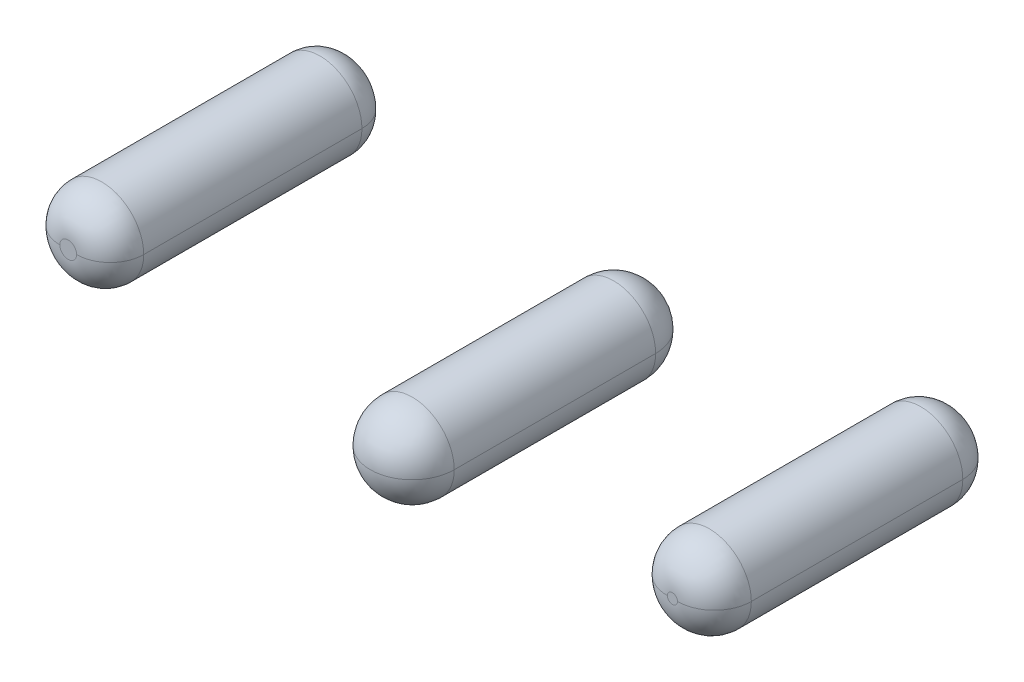
ISO-10303-21;
HEADER;
FILE_DESCRIPTION(('STEP AP214'),'2;1');
FILE_NAME('part.step','',(''),(''),'','','');
FILE_SCHEMA(('AUTOMOTIVE_DESIGN { 1 0 10303 214 1 1 1 1 }'));
ENDSEC;
DATA;
#1=APPLICATION_CONTEXT('core data for automotive mechanical design processes');
#2=APPLICATION_PROTOCOL_DEFINITION('international standard','automotive_design',2000,#1);
#3=PRODUCT_CONTEXT('',#1,'mechanical');
#4=PRODUCT('Part','Part','',(#3));
#5=PRODUCT_RELATED_PRODUCT_CATEGORY('part','',(#4));
#6=PRODUCT_DEFINITION_FORMATION('','',#4);
#7=PRODUCT_DEFINITION_CONTEXT('part definition',#1,'design');
#8=PRODUCT_DEFINITION('design','',#6,#7);
#9=PRODUCT_DEFINITION_SHAPE('','',#8);
#10=(LENGTH_UNIT() NAMED_UNIT(*) SI_UNIT(.MILLI.,.METRE.));
#11=(NAMED_UNIT(*) PLANE_ANGLE_UNIT() SI_UNIT($,.RADIAN.));
#12=(NAMED_UNIT(*) SI_UNIT($,.STERADIAN.) SOLID_ANGLE_UNIT());
#13=UNCERTAINTY_MEASURE_WITH_UNIT(LENGTH_MEASURE(1.E-05),#10,'distance_accuracy_value','');
#14=(GEOMETRIC_REPRESENTATION_CONTEXT(3) GLOBAL_UNCERTAINTY_ASSIGNED_CONTEXT((#13)) GLOBAL_UNIT_ASSIGNED_CONTEXT((#10,
#11,#12)) REPRESENTATION_CONTEXT('',''));
#15=CARTESIAN_POINT('',(0.,0.,0.));
#16=DIRECTION('',(0.,0.,1.));
#17=DIRECTION('',(1.,0.,0.));
#18=AXIS2_PLACEMENT_3D('',#15,#16,#17);
#19=CARTESIAN_POINT('',(1.8,-6.76461381012,0.7));
#20=DIRECTION('',(0.,0.,1.));
#21=DIRECTION('',(1.,0.,0.));
#22=AXIS2_PLACEMENT_3D('',#19,#20,#21);
#23=PLANE('',#22);
#24=CARTESIAN_POINT('',(1.8,-6.76461381012,0.7));
#25=DIRECTION('',(0.,0.,1.));
#26=DIRECTION('',(1.,0.,0.));
#27=AXIS2_PLACEMENT_3D('',#24,#25,#26);
#28=CIRCLE('',#27,0.03);
#29=CARTESIAN_POINT('',(1.83,-6.76461381012,0.7));
#30=VERTEX_POINT('',#29);
#31=CARTESIAN_POINT('',(1.77,-6.76461381012,0.7));
#32=VERTEX_POINT('',#31);
#33=EDGE_CURVE('P0_E92',#30,#32,#28,.T.);
#34=ORIENTED_EDGE('',*,*,#33,.T.);
#35=CARTESIAN_POINT('',(1.8,-6.76461381012,0.7));
#36=DIRECTION('',(0.,0.,1.));
#37=DIRECTION('',(1.,0.,0.));
#38=AXIS2_PLACEMENT_3D('',#35,#36,#37);
#39=CIRCLE('',#38,0.03);
#40=EDGE_CURVE('P0_E11',#32,#30,#39,.T.);
#41=ORIENTED_EDGE('',*,*,#40,.T.);
#42=EDGE_LOOP('',(#34,#41));
#43=FACE_BOUND('',#42,.T.);
#44=ADVANCED_FACE('P0_F17',(#43),#23,.T.);
#45=CARTESIAN_POINT('',(1.8,-6.76461381012,0.48));
#46=DIRECTION('',(0.,0.,1.));
#47=DIRECTION('',(-1.,0.,0.));
#48=AXIS2_PLACEMENT_3D('',#45,#46,#47);
#49=DEGENERATE_TOROIDAL_SURFACE('',#48,0.03,0.22,.T.);
#50=CARTESIAN_POINT('',(1.77,-6.76461381012,0.48));
#51=DIRECTION('',(0.,1.,0.));
#52=DIRECTION('',(1.,0.,0.));
#53=AXIS2_PLACEMENT_3D('',#50,#51,#52);
#54=CIRCLE('',#53,0.22);
#55=CARTESIAN_POINT('',(1.55,-6.76461381012,0.48));
#56=VERTEX_POINT('',#55);
#57=EDGE_CURVE('P0_E85',#56,#32,#54,.T.);
#58=ORIENTED_EDGE('',*,*,#57,.F.);
#59=CARTESIAN_POINT('',(1.8,-6.76461381012,0.480000000447));
#60=DIRECTION('',(0.,0.,-1.));
#61=DIRECTION('',(1.,0.,0.));
#62=AXIS2_PLACEMENT_3D('',#59,#60,#61);
#63=CIRCLE('',#62,0.25);
#64=CARTESIAN_POINT('',(2.05,-6.76461381012,0.48));
#65=VERTEX_POINT('',#64);
#66=EDGE_CURVE('P0_E87',#65,#56,#63,.T.);
#67=ORIENTED_EDGE('',*,*,#66,.F.);
#68=CARTESIAN_POINT('',(1.83,-6.76461381012,0.48));
#69=DIRECTION('',(0.,-1.,0.));
#70=DIRECTION('',(1.,0.,0.));
#71=AXIS2_PLACEMENT_3D('',#68,#69,#70);
#72=CIRCLE('',#71,0.22);
#73=EDGE_CURVE('P0_E27',#65,#30,#72,.T.);
#74=ORIENTED_EDGE('',*,*,#73,.T.);
#75=ORIENTED_EDGE('',*,*,#40,.F.);
#76=EDGE_LOOP('',(#58,#67,#74,#75));
#77=FACE_BOUND('',#76,.T.);
#78=ADVANCED_FACE('P0_F19',(#77),#49,.T.);
#79=CARTESIAN_POINT('',(1.8,-6.76461381012,0.48));
#80=DIRECTION('',(0.,0.,1.));
#81=DIRECTION('',(1.,0.,0.));
#82=AXIS2_PLACEMENT_3D('',#79,#80,#81);
#83=DEGENERATE_TOROIDAL_SURFACE('',#82,0.03,0.22,.T.);
#84=CARTESIAN_POINT('',(1.8,-6.76461381012,0.480000000447));
#85=DIRECTION('',(0.,0.,-1.));
#86=DIRECTION('',(1.,0.,0.));
#87=AXIS2_PLACEMENT_3D('',#84,#85,#86);
#88=CIRCLE('',#87,0.25);
#89=EDGE_CURVE('P0_E101',#56,#65,#88,.T.);
#90=ORIENTED_EDGE('',*,*,#89,.F.);
#91=ORIENTED_EDGE('',*,*,#57,.T.);
#92=ORIENTED_EDGE('',*,*,#33,.F.);
#93=ORIENTED_EDGE('',*,*,#73,.F.);
#94=EDGE_LOOP('',(#90,#91,#92,#93));
#95=FACE_BOUND('',#94,.T.);
#96=ADVANCED_FACE('P0_F102',(#95),#83,.T.);
#97=CARTESIAN_POINT('',(1.8,-6.76461381012,-1.));
#98=DIRECTION('',(0.,0.,1.));
#99=DIRECTION('',(1.,0.,0.));
#100=AXIS2_PLACEMENT_3D('',#97,#98,#99);
#101=CYLINDRICAL_SURFACE('',#100,0.25);
#102=DIRECTION('',(0.,0.,1.));
#103=VECTOR('',#102,1.);
#104=CARTESIAN_POINT('',(1.55,-6.76461381012,-1.));
#105=LINE('',#104,#103);
#106=CARTESIAN_POINT('',(1.55,-6.76461381012,-0.78));
#107=VERTEX_POINT('',#106);
#108=EDGE_CURVE('P0_E97',#107,#56,#105,.T.);
#109=ORIENTED_EDGE('',*,*,#108,.F.);
#110=CARTESIAN_POINT('',(1.8,-6.76461381012,-0.78));
#111=DIRECTION('',(0.,0.,1.));
#112=DIRECTION('',(1.,0.,0.));
#113=AXIS2_PLACEMENT_3D('',#110,#111,#112);
#114=CIRCLE('',#113,0.25);
#115=CARTESIAN_POINT('',(2.05,-6.76461381012,-0.78));
#116=VERTEX_POINT('',#115);
#117=EDGE_CURVE('P0_E109',#107,#116,#114,.T.);
#118=ORIENTED_EDGE('',*,*,#117,.T.);
#119=DIRECTION('',(0.,0.,1.));
#120=VECTOR('',#119,1.);
#121=CARTESIAN_POINT('',(2.05,-6.76461381012,-1.));
#122=LINE('',#121,#120);
#123=EDGE_CURVE('P0_E80',#116,#65,#122,.T.);
#124=ORIENTED_EDGE('',*,*,#123,.T.);
#125=ORIENTED_EDGE('',*,*,#66,.T.);
#126=EDGE_LOOP('',(#109,#118,#124,#125));
#127=FACE_BOUND('',#126,.T.);
#128=ADVANCED_FACE('P0_F95',(#127),#101,.T.);
#129=CARTESIAN_POINT('',(1.8,-6.76461381012,-1.));
#130=DIRECTION('',(0.,0.,1.));
#131=DIRECTION('',(1.,0.,0.));
#132=AXIS2_PLACEMENT_3D('',#129,#130,#131);
#133=CYLINDRICAL_SURFACE('',#132,0.25);
#134=CARTESIAN_POINT('',(1.8,-6.76461381012,-0.78));
#135=DIRECTION('',(0.,0.,1.));
#136=DIRECTION('',(1.,0.,0.));
#137=AXIS2_PLACEMENT_3D('',#134,#135,#136);
#138=CIRCLE('',#137,0.25);
#139=EDGE_CURVE('P0_E106',#116,#107,#138,.T.);
#140=ORIENTED_EDGE('',*,*,#139,.T.);
#141=ORIENTED_EDGE('',*,*,#108,.T.);
#142=ORIENTED_EDGE('',*,*,#89,.T.);
#143=ORIENTED_EDGE('',*,*,#123,.F.);
#144=EDGE_LOOP('',(#140,#141,#142,#143));
#145=FACE_BOUND('',#144,.T.);
#146=ADVANCED_FACE('P0_F104',(#145),#133,.T.);
#147=CARTESIAN_POINT('',(1.8,-6.76461381012,-0.78));
#148=DIRECTION('',(0.,0.,1.));
#149=DIRECTION('',(-1.,0.,0.));
#150=AXIS2_PLACEMENT_3D('',#147,#148,#149);
#151=DEGENERATE_TOROIDAL_SURFACE('',#150,0.03,0.22,.T.);
#152=CARTESIAN_POINT('',(1.77,-6.76461381012,-0.78));
#153=DIRECTION('',(0.,1.,0.));
#154=DIRECTION('',(1.,0.,0.));
#155=AXIS2_PLACEMENT_3D('',#152,#153,#154);
#156=CIRCLE('',#155,0.22);
#157=CARTESIAN_POINT('',(1.77,-6.76461381012,-1.));
#158=VERTEX_POINT('',#157);
#159=EDGE_CURVE('P0_E21',#158,#107,#156,.T.);
#160=ORIENTED_EDGE('',*,*,#159,.F.);
#161=CARTESIAN_POINT('',(1.82999999933,-6.76461381012,-1.));
#162=CARTESIAN_POINT('',(1.82999999933,-6.76649489867,-1.));
#163=CARTESIAN_POINT('',(1.82999999933,-6.76837598723,-1.));
#164=CARTESIAN_POINT('',(1.82969427145,-6.77030627676,-1.));
#165=CARTESIAN_POINT('',(1.82864237748,-6.77354367352,-1.));
#166=CARTESIAN_POINT('',(1.82759048351,-6.77678107028,-1.));
#167=CARTESIAN_POINT('',(1.82692351139,-6.77819326183,-1.));
#168=CARTESIAN_POINT('',(1.82544043143,-6.7805156541,-1.));
#169=CARTESIAN_POINT('',(1.82395735147,-6.78283804637,-1.));
#170=CARTESIAN_POINT('',(1.82317800172,-6.78381948066,-1.));
#171=CARTESIAN_POINT('',(1.82145488329,-6.78558254834,-1.));
#172=CARTESIAN_POINT('',(1.81973176487,-6.78734561603,-1.));
#173=CARTESIAN_POINT('',(1.8187684476,-6.78814725178,-1.));
#174=CARTESIAN_POINT('',(1.81618327407,-6.78988280485,-1.));
#175=CARTESIAN_POINT('',(1.81359810054,-6.79161835792,-1.));
#176=CARTESIAN_POINT('',(1.81182506578,-6.7924404485,-1.));
#177=CARTESIAN_POINT('',(1.80855089777,-6.79337159941,-1.));
#178=CARTESIAN_POINT('',(1.80527672977,-6.79430275032,-1.));
#179=CARTESIAN_POINT('',(1.80373249266,-6.79453613543,-1.));
#180=CARTESIAN_POINT('',(1.80097767055,-6.79459928042,-1.));
#181=CARTESIAN_POINT('',(1.79822284845,-6.79466242542,-1.));
#182=CARTESIAN_POINT('',(1.79697361,-6.79456240789,-1.));
#183=CARTESIAN_POINT('',(1.79454937343,-6.79411449943,-1.));
#184=CARTESIAN_POINT('',(1.79212513686,-6.79366659097,-1.));
#185=CARTESIAN_POINT('',(1.79092263524,-6.79331361869,-1.));
#186=CARTESIAN_POINT('',(1.78804074295,-6.79213465101,-1.));
#187=CARTESIAN_POINT('',(1.78515885065,-6.79095568334,-1.));
#188=CARTESIAN_POINT('',(1.78348803885,-6.78994184025,-1.));
#189=CARTESIAN_POINT('',(1.78088996539,-6.78774246914,-1.));
#190=CARTESIAN_POINT('',(1.77829189192,-6.78554309804,-1.));
#191=CARTESIAN_POINT('',(1.77723738351,-6.78439107917,-1.));
#192=CARTESIAN_POINT('',(1.77564945112,-6.78213907957,-1.));
#193=CARTESIAN_POINT('',(1.77406151872,-6.77988707996,-1.));
#194=CARTESIAN_POINT('',(1.77344824793,-6.77879414885,-1.));
#195=CARTESIAN_POINT('',(1.77246888313,-6.77653176313,-1.));
#196=CARTESIAN_POINT('',(1.77148951833,-6.7742693774,-1.));
#197=CARTESIAN_POINT('',(1.77111231422,-6.77307425553,-1.));
#198=CARTESIAN_POINT('',(1.7706187629,-6.77067542295,-1.));
#199=CARTESIAN_POINT('',(1.77012521157,-6.76827659038,-1.));
#200=CARTESIAN_POINT('',(1.77000000067,-6.76704670156,-1.));
#201=CARTESIAN_POINT('',(1.77000000067,-6.76583025584,-1.));
#202=CARTESIAN_POINT('',(1.77000000067,-6.76461381012,-1.));
#203=(BOUNDED_CURVE() B_SPLINE_CURVE(5,(#161,#162,#163,#164,#165,#166,#167,#168,#169,#170,#171,
#172,#173,#174,#175,#176,#177,#178,#179,#180,#181,#182,#183,#184,#185,#186,#187,#188,#189,#190,
#191,#192,#193,#194,#195,#196,#197,#198,#199,#200,#201,#202),.UNSPECIFIED.,.F.,
.F.) B_SPLINE_CURVE_WITH_KNOTS((6,3,3,3,3,3,3,3,3,3,3,3,3,6),(0.,0.0133013047494,
0.0240699176376,0.0327859551377,0.0415019926378,0.0548032967796,0.0655719096938,0.074287947302,
0.0830039849101,0.096305290455,0.107073902843,0.115789940201,0.124505977558,0.133107547737),
.UNSPECIFIED.) CURVE() GEOMETRIC_REPRESENTATION_ITEM() RATIONAL_B_SPLINE_CURVE((1.,1.,1.,1.,1.,
1.,1.,1.,1.,1.,1.,1.,1.,1.,1.,1.,1.,1.,1.,1.,1.,1.,1.,1.,1.,1.,1.,1.,1.,1.,1.,1.,1.,1.,1.,1.,1.,
1.,1.,1.,1.,1.)) REPRESENTATION_ITEM(''));
#204=CARTESIAN_POINT('',(1.83,-6.76461381012,-1.));
#205=VERTEX_POINT('',#204);
#206=EDGE_CURVE('P0_E61',#205,#158,#203,.T.);
#207=ORIENTED_EDGE('',*,*,#206,.F.);
#208=CARTESIAN_POINT('',(1.83,-6.76461381012,-0.78));
#209=DIRECTION('',(0.,-1.,0.));
#210=DIRECTION('',(1.,0.,0.));
#211=AXIS2_PLACEMENT_3D('',#208,#209,#210);
#212=CIRCLE('',#211,0.22);
#213=EDGE_CURVE('P0_E118',#205,#116,#212,.T.);
#214=ORIENTED_EDGE('',*,*,#213,.T.);
#215=ORIENTED_EDGE('',*,*,#117,.F.);
#216=EDGE_LOOP('',(#160,#207,#214,#215));
#217=FACE_BOUND('',#216,.T.);
#218=ADVANCED_FACE('P0_F133',(#217),#151,.T.);
#219=CARTESIAN_POINT('',(1.8,-6.76461381012,-1.));
#220=DIRECTION('',(0.,0.,1.));
#221=DIRECTION('',(1.,0.,0.));
#222=AXIS2_PLACEMENT_3D('',#219,#220,#221);
#223=PLANE('',#222);
#224=ORIENTED_EDGE('',*,*,#206,.T.);
#225=CARTESIAN_POINT('',(1.8,-6.76461381012,-1.));
#226=DIRECTION('',(0.,0.,-1.));
#227=DIRECTION('',(1.,0.,0.));
#228=AXIS2_PLACEMENT_3D('',#225,#226,#227);
#229=CIRCLE('',#228,0.03);
#230=EDGE_CURVE('P0_E235',#158,#205,#229,.T.);
#231=ORIENTED_EDGE('',*,*,#230,.T.);
#232=EDGE_LOOP('',(#224,#231));
#233=FACE_BOUND('',#232,.T.);
#234=ADVANCED_FACE('P0_F137',(#233),#223,.F.);
#235=CARTESIAN_POINT('',(1.8,-6.76461381012,-0.78));
#236=DIRECTION('',(0.,0.,1.));
#237=DIRECTION('',(1.,0.,0.));
#238=AXIS2_PLACEMENT_3D('',#235,#236,#237);
#239=DEGENERATE_TOROIDAL_SURFACE('',#238,0.03,0.22,.T.);
#240=ORIENTED_EDGE('',*,*,#230,.F.);
#241=ORIENTED_EDGE('',*,*,#159,.T.);
#242=ORIENTED_EDGE('',*,*,#139,.F.);
#243=ORIENTED_EDGE('',*,*,#213,.F.);
#244=EDGE_LOOP('',(#240,#241,#242,#243));
#245=FACE_BOUND('',#244,.T.);
#246=ADVANCED_FACE('P0_F134',(#245),#239,.T.);
#247=CLOSED_SHELL('',(#44,#78,#96,#128,#146,#218,#234,#246));
#248=MANIFOLD_SOLID_BREP('P0_B1',#247);
#249=CARTESIAN_POINT('',(0.,-7.,-0.75));
#250=DIRECTION('',(0.,1.,0.));
#251=DIRECTION('',(0.,0.,-1.));
#252=AXIS2_PLACEMENT_3D('',#249,#250,#251);
#253=SPHERICAL_SURFACE('',#252,0.25);
#254=CARTESIAN_POINT('',(0.,-7.,-0.75));
#255=DIRECTION('',(0.,1.,0.));
#256=DIRECTION('',(1.,0.,0.));
#257=AXIS2_PLACEMENT_3D('',#254,#255,#256);
#258=CIRCLE('',#257,0.25);
#259=CARTESIAN_POINT('',(0.,-7.,-1.));
#260=VERTEX_POINT('',#259);
#261=CARTESIAN_POINT('',(-0.25,-7.,-0.75));
#262=VERTEX_POINT('',#261);
#263=EDGE_CURVE('P1_E121',#260,#262,#258,.T.);
#264=ORIENTED_EDGE('',*,*,#263,.T.);
#265=CARTESIAN_POINT('',(0.,-7.,-0.75));
#266=DIRECTION('',(0.,0.,1.));
#267=DIRECTION('',(1.,0.,0.));
#268=AXIS2_PLACEMENT_3D('',#265,#266,#267);
#269=CIRCLE('',#268,0.25);
#270=CARTESIAN_POINT('',(0.,-6.75,-0.75));
#271=VERTEX_POINT('',#270);
#272=EDGE_CURVE('P1_E102',#271,#262,#269,.T.);
#273=ORIENTED_EDGE('',*,*,#272,.F.);
#274=CARTESIAN_POINT('',(0.,-7.,-0.75));
#275=DIRECTION('',(0.,0.,1.));
#276=DIRECTION('',(1.,0.,0.));
#277=AXIS2_PLACEMENT_3D('',#274,#275,#276);
#278=CIRCLE('',#277,0.25);
#279=CARTESIAN_POINT('',(0.25,-7.,-0.75));
#280=VERTEX_POINT('',#279);
#281=EDGE_CURVE('P1_E108',#280,#271,#278,.T.);
#282=ORIENTED_EDGE('',*,*,#281,.F.);
#283=CARTESIAN_POINT('',(0.,-7.,-0.75));
#284=DIRECTION('',(0.,-1.,0.));
#285=DIRECTION('',(1.,0.,0.));
#286=AXIS2_PLACEMENT_3D('',#283,#284,#285);
#287=CIRCLE('',#286,0.25);
#288=EDGE_CURVE('P1_E28',#260,#280,#287,.T.);
#289=ORIENTED_EDGE('',*,*,#288,.F.);
#290=EDGE_LOOP('',(#264,#273,#282,#289));
#291=FACE_BOUND('',#290,.T.);
#292=ADVANCED_FACE('P1_F17',(#291),#253,.T.);
#293=CARTESIAN_POINT('',(0.,-7.,-1.));
#294=DIRECTION('',(0.,0.,1.));
#295=DIRECTION('',(1.,0.,0.));
#296=AXIS2_PLACEMENT_3D('',#293,#294,#295);
#297=CYLINDRICAL_SURFACE('',#296,0.25);
#298=DIRECTION('',(0.,0.,1.));
#299=VECTOR('',#298,1.);
#300=CARTESIAN_POINT('',(-0.25,-7.,-1.));
#301=LINE('',#300,#299);
#302=CARTESIAN_POINT('',(-0.25,-7.,0.449999999255));
#303=VERTEX_POINT('',#302);
#304=EDGE_CURVE('P1_E74',#262,#303,#301,.T.);
#305=ORIENTED_EDGE('',*,*,#304,.F.);
#306=CARTESIAN_POINT('',(0.,-7.,-0.75));
#307=DIRECTION('',(0.,0.,1.));
#308=DIRECTION('',(1.,0.,0.));
#309=AXIS2_PLACEMENT_3D('',#306,#307,#308);
#310=CIRCLE('',#309,0.25);
#311=CARTESIAN_POINT('',(0.,-7.25,-0.75));
#312=VERTEX_POINT('',#311);
#313=EDGE_CURVE('P1_E81',#262,#312,#310,.T.);
#314=ORIENTED_EDGE('',*,*,#313,.T.);
#315=CARTESIAN_POINT('',(0.,-7.,-0.75));
#316=DIRECTION('',(0.,0.,1.));
#317=DIRECTION('',(1.,0.,0.));
#318=AXIS2_PLACEMENT_3D('',#315,#316,#317);
#319=CIRCLE('',#318,0.25);
#320=EDGE_CURVE('P1_E11',#312,#280,#319,.T.);
#321=ORIENTED_EDGE('',*,*,#320,.T.);
#322=DIRECTION('',(0.,0.,1.));
#323=VECTOR('',#322,1.);
#324=CARTESIAN_POINT('',(0.25,-7.,-1.));
#325=LINE('',#324,#323);
#326=CARTESIAN_POINT('',(0.25,-7.,0.449999999255));
#327=VERTEX_POINT('',#326);
#328=EDGE_CURVE('P1_E111',#280,#327,#325,.T.);
#329=ORIENTED_EDGE('',*,*,#328,.T.);
#330=CARTESIAN_POINT('',(0.,-7.,0.45));
#331=DIRECTION('',(0.,0.,1.));
#332=DIRECTION('',(1.,0.,0.));
#333=AXIS2_PLACEMENT_3D('',#330,#331,#332);
#334=CIRCLE('',#333,0.25);
#335=CARTESIAN_POINT('',(0.,-7.25,0.45));
#336=VERTEX_POINT('',#335);
#337=EDGE_CURVE('P1_E78',#336,#327,#334,.T.);
#338=ORIENTED_EDGE('',*,*,#337,.F.);
#339=CARTESIAN_POINT('',(0.,-7.,0.45));
#340=DIRECTION('',(0.,0.,1.));
#341=DIRECTION('',(1.,0.,0.));
#342=AXIS2_PLACEMENT_3D('',#339,#340,#341);
#343=CIRCLE('',#342,0.25);
#344=EDGE_CURVE('P1_E69',#303,#336,#343,.T.);
#345=ORIENTED_EDGE('',*,*,#344,.F.);
#346=EDGE_LOOP('',(#305,#314,#321,#329,#338,#345));
#347=FACE_BOUND('',#346,.T.);
#348=ADVANCED_FACE('P1_F71',(#347),#297,.T.);
#349=CARTESIAN_POINT('',(0.,-7.,0.45));
#350=DIRECTION('',(0.,1.,0.));
#351=DIRECTION('',(0.,0.,1.));
#352=AXIS2_PLACEMENT_3D('',#349,#350,#351);
#353=SPHERICAL_SURFACE('',#352,0.25);
#354=CARTESIAN_POINT('',(0.,-7.,0.45));
#355=DIRECTION('',(0.,-1.,0.));
#356=DIRECTION('',(1.,0.,0.));
#357=AXIS2_PLACEMENT_3D('',#354,#355,#356);
#358=CIRCLE('',#357,0.25);
#359=CARTESIAN_POINT('',(0.,-7.,0.7));
#360=VERTEX_POINT('',#359);
#361=EDGE_CURVE('P1_E89',#327,#360,#358,.T.);
#362=ORIENTED_EDGE('',*,*,#361,.F.);
#363=CARTESIAN_POINT('',(0.,-7.,0.449999999255));
#364=DIRECTION('',(0.,0.,-1.));
#365=DIRECTION('',(1.,0.,0.));
#366=AXIS2_PLACEMENT_3D('',#363,#364,#365);
#367=CIRCLE('',#366,0.25);
#368=CARTESIAN_POINT('',(0.,-6.75,0.449999999255));
#369=VERTEX_POINT('',#368);
#370=EDGE_CURVE('P1_E21',#369,#327,#367,.T.);
#371=ORIENTED_EDGE('',*,*,#370,.F.);
#372=CARTESIAN_POINT('',(0.,-7.,0.449999999255));
#373=DIRECTION('',(0.,0.,-1.));
#374=DIRECTION('',(1.,0.,0.));
#375=AXIS2_PLACEMENT_3D('',#372,#373,#374);
#376=CIRCLE('',#375,0.25);
#377=EDGE_CURVE('P1_E94',#303,#369,#376,.T.);
#378=ORIENTED_EDGE('',*,*,#377,.F.);
#379=CARTESIAN_POINT('',(0.,-7.,0.45));
#380=DIRECTION('',(0.,1.,0.));
#381=DIRECTION('',(1.,0.,0.));
#382=AXIS2_PLACEMENT_3D('',#379,#380,#381);
#383=CIRCLE('',#382,0.25);
#384=EDGE_CURVE('P1_E82',#303,#360,#383,.T.);
#385=ORIENTED_EDGE('',*,*,#384,.T.);
#386=EDGE_LOOP('',(#362,#371,#378,#385));
#387=FACE_BOUND('',#386,.T.);
#388=ADVANCED_FACE('P1_F95',(#387),#353,.T.);
#389=CARTESIAN_POINT('',(0.,-7.,-0.75));
#390=DIRECTION('',(0.,1.,0.));
#391=DIRECTION('',(0.,0.,-1.));
#392=AXIS2_PLACEMENT_3D('',#389,#390,#391);
#393=SPHERICAL_SURFACE('',#392,0.25);
#394=ORIENTED_EDGE('',*,*,#313,.F.);
#395=ORIENTED_EDGE('',*,*,#263,.F.);
#396=ORIENTED_EDGE('',*,*,#288,.T.);
#397=ORIENTED_EDGE('',*,*,#320,.F.);
#398=EDGE_LOOP('',(#394,#395,#396,#397));
#399=FACE_BOUND('',#398,.T.);
#400=ADVANCED_FACE('P1_F129',(#399),#393,.T.);
#401=CARTESIAN_POINT('',(0.,-7.,0.45));
#402=DIRECTION('',(0.,1.,0.));
#403=DIRECTION('',(0.,0.,1.));
#404=AXIS2_PLACEMENT_3D('',#401,#402,#403);
#405=SPHERICAL_SURFACE('',#404,0.25);
#406=ORIENTED_EDGE('',*,*,#337,.T.);
#407=ORIENTED_EDGE('',*,*,#361,.T.);
#408=ORIENTED_EDGE('',*,*,#384,.F.);
#409=ORIENTED_EDGE('',*,*,#344,.T.);
#410=EDGE_LOOP('',(#406,#407,#408,#409));
#411=FACE_BOUND('',#410,.T.);
#412=ADVANCED_FACE('P1_F87',(#411),#405,.T.);
#413=CARTESIAN_POINT('',(0.,-7.,-1.));
#414=DIRECTION('',(0.,0.,1.));
#415=DIRECTION('',(1.,0.,0.));
#416=AXIS2_PLACEMENT_3D('',#413,#414,#415);
#417=CYLINDRICAL_SURFACE('',#416,0.25);
#418=ORIENTED_EDGE('',*,*,#281,.T.);
#419=ORIENTED_EDGE('',*,*,#272,.T.);
#420=ORIENTED_EDGE('',*,*,#304,.T.);
#421=ORIENTED_EDGE('',*,*,#377,.T.);
#422=ORIENTED_EDGE('',*,*,#370,.T.);
#423=ORIENTED_EDGE('',*,*,#328,.F.);
#424=EDGE_LOOP('',(#418,#419,#420,#421,#422,#423));
#425=FACE_BOUND('',#424,.T.);
#426=ADVANCED_FACE('P1_F19',(#425),#417,.T.);
#427=CLOSED_SHELL('',(#292,#348,#388,#400,#412,#426));
#428=MANIFOLD_SOLID_BREP('P1_B1',#427);
#429=CARTESIAN_POINT('',(-1.8,-6.76461381012,-0.8));
#430=DIRECTION('',(0.,0.,1.));
#431=DIRECTION('',(-1.,0.,0.));
#432=AXIS2_PLACEMENT_3D('',#429,#430,#431);
#433=DEGENERATE_TOROIDAL_SURFACE('',#432,0.05,0.2,.T.);
#434=CARTESIAN_POINT('',(-1.85,-6.76461381012,-0.8));
#435=DIRECTION('',(0.,1.,0.));
#436=DIRECTION('',(1.,0.,0.));
#437=AXIS2_PLACEMENT_3D('',#434,#435,#436);
#438=CIRCLE('',#437,0.2);
#439=CARTESIAN_POINT('',(-1.85,-6.76461381012,-1.));
#440=VERTEX_POINT('',#439);
#441=CARTESIAN_POINT('',(-2.05,-6.76461381012,-0.8));
#442=VERTEX_POINT('',#441);
#443=EDGE_CURVE('P2_E97',#440,#442,#438,.T.);
#444=ORIENTED_EDGE('',*,*,#443,.F.);
#445=CARTESIAN_POINT('',(-1.74999999925,-6.76461381012,-1.));
#446=CARTESIAN_POINT('',(-1.74999999925,-6.77025904555,-1.));
#447=CARTESIAN_POINT('',(-1.75079671607,-6.77590371762,-1.));
#448=CARTESIAN_POINT('',(-1.75245412511,-6.78157966611,-1.));
#449=CARTESIAN_POINT('',(-1.7578301373,-6.79335992599,-1.));
#450=CARTESIAN_POINT('',(-1.76666787357,-6.80292608087,-1.));
#451=CARTESIAN_POINT('',(-1.77287042908,-6.8075428136,-1.));
#452=CARTESIAN_POINT('',(-1.78543999414,-6.81368535226,-1.));
#453=CARTESIAN_POINT('',(-1.79930278122,-6.81526833581,-1.));
#454=CARTESIAN_POINT('',(-1.80631490552,-6.81487840567,-1.));
#455=CARTESIAN_POINT('',(-1.81840731258,-6.81211102171,-1.));
#456=CARTESIAN_POINT('',(-1.82907946309,-6.80587892699,-1.));
#457=CARTESIAN_POINT('',(-1.83370525882,-6.80219580211,-1.));
#458=CARTESIAN_POINT('',(-1.84182468418,-6.79355578805,-1.));
#459=CARTESIAN_POINT('',(-1.84712718851,-6.78293248432,-1.));
#460=CARTESIAN_POINT('',(-1.84907167079,-6.7768018716,-1.));
#461=CARTESIAN_POINT('',(-1.85000000075,-6.77070751264,-1.));
#462=CARTESIAN_POINT('',(-1.85000000075,-6.76461381012,-1.));
#463=(BOUNDED_CURVE() B_SPLINE_CURVE(5,(#445,#446,#447,#448,#449,#450,#451,#452,#453,#454,#455,
#456,#457,#458,#459,#460,#461,#462),.UNSPECIFIED.,.F.,.F.) B_SPLINE_CURVE_WITH_KNOTS((6,3,3,3,3,
6),(0.,0.0399178425769,0.0906557576099,0.137277033852,0.177194876337,0.220283860123),
.UNSPECIFIED.) CURVE() GEOMETRIC_REPRESENTATION_ITEM() RATIONAL_B_SPLINE_CURVE((1.,1.,1.,1.,1.,
1.,1.,1.,1.,1.,1.,1.,1.,1.,1.,1.,1.,1.)) REPRESENTATION_ITEM(''));
#464=CARTESIAN_POINT('',(-1.75,-6.76461381012,-1.));
#465=VERTEX_POINT('',#464);
#466=EDGE_CURVE('P2_E11',#465,#440,#463,.T.);
#467=ORIENTED_EDGE('',*,*,#466,.F.);
#468=CARTESIAN_POINT('',(-1.75,-6.76461381012,-0.8));
#469=DIRECTION('',(0.,-1.,0.));
#470=DIRECTION('',(1.,0.,0.));
#471=AXIS2_PLACEMENT_3D('',#468,#469,#470);
#472=CIRCLE('',#471,0.2);
#473=CARTESIAN_POINT('',(-1.55,-6.76461381012,-0.8));
#474=VERTEX_POINT('',#473);
#475=EDGE_CURVE('P2_E90',#465,#474,#472,.T.);
#476=ORIENTED_EDGE('',*,*,#475,.T.);
#477=CARTESIAN_POINT('',(-1.8,-6.76461381012,-0.8));
#478=DIRECTION('',(0.,0.,1.));
#479=DIRECTION('',(-1.,0.,0.));
#480=AXIS2_PLACEMENT_3D('',#477,#478,#479);
#481=CIRCLE('',#480,0.25);
#482=EDGE_CURVE('P2_E28',#442,#474,#481,.T.);
#483=ORIENTED_EDGE('',*,*,#482,.F.);
#484=EDGE_LOOP('',(#444,#467,#476,#483));
#485=FACE_BOUND('',#484,.T.);
#486=ADVANCED_FACE('P2_F17',(#485),#433,.T.);
#487=CARTESIAN_POINT('',(-1.8,-6.76461381012,-1.));
#488=DIRECTION('',(0.,0.,1.));
#489=DIRECTION('',(1.,0.,0.));
#490=AXIS2_PLACEMENT_3D('',#487,#488,#489);
#491=PLANE('',#490);
#492=ORIENTED_EDGE('',*,*,#466,.T.);
#493=CARTESIAN_POINT('',(-1.8,-6.76461381012,-1.));
#494=DIRECTION('',(0.,0.,-1.));
#495=DIRECTION('',(1.,0.,0.));
#496=AXIS2_PLACEMENT_3D('',#493,#494,#495);
#497=CIRCLE('',#496,0.05);
#498=EDGE_CURVE('P2_E128',#440,#465,#497,.T.);
#499=ORIENTED_EDGE('',*,*,#498,.T.);
#500=EDGE_LOOP('',(#492,#499));
#501=FACE_BOUND('',#500,.T.);
#502=ADVANCED_FACE('P2_F19',(#501),#491,.F.);
#503=CARTESIAN_POINT('',(-1.8,-6.76461381012,-1.));
#504=DIRECTION('',(0.,0.,1.));
#505=DIRECTION('',(1.,0.,0.));
#506=AXIS2_PLACEMENT_3D('',#503,#504,#505);
#507=CYLINDRICAL_SURFACE('',#506,0.25);
#508=DIRECTION('',(0.,0.,1.));
#509=VECTOR('',#508,1.);
#510=CARTESIAN_POINT('',(-2.05,-6.76461381012,-1.));
#511=LINE('',#510,#509);
#512=CARTESIAN_POINT('',(-2.05,-6.76461381012,0.5));
#513=VERTEX_POINT('',#512);
#514=EDGE_CURVE('P2_E87',#442,#513,#511,.T.);
#515=ORIENTED_EDGE('',*,*,#514,.F.);
#516=ORIENTED_EDGE('',*,*,#482,.T.);
#517=DIRECTION('',(0.,0.,1.));
#518=VECTOR('',#517,1.);
#519=CARTESIAN_POINT('',(-1.55,-6.76461381012,-1.));
#520=LINE('',#519,#518);
#521=CARTESIAN_POINT('',(-1.55,-6.76461381012,0.5));
#522=VERTEX_POINT('',#521);
#523=EDGE_CURVE('P2_E85',#474,#522,#520,.T.);
#524=ORIENTED_EDGE('',*,*,#523,.T.);
#525=CARTESIAN_POINT('',(-1.8,-6.76461381012,0.5));
#526=DIRECTION('',(0.,0.,-1.));
#527=DIRECTION('',(1.,0.,0.));
#528=AXIS2_PLACEMENT_3D('',#525,#526,#527);
#529=CIRCLE('',#528,0.25);
#530=EDGE_CURVE('P2_E55',#522,#513,#529,.T.);
#531=ORIENTED_EDGE('',*,*,#530,.T.);
#532=EDGE_LOOP('',(#515,#516,#524,#531));
#533=FACE_BOUND('',#532,.T.);
#534=ADVANCED_FACE('P2_F83',(#533),#507,.T.);
#535=CARTESIAN_POINT('',(-1.8,-6.76461381012,-0.8));
#536=DIRECTION('',(0.,0.,1.));
#537=DIRECTION('',(1.,0.,0.));
#538=AXIS2_PLACEMENT_3D('',#535,#536,#537);
#539=DEGENERATE_TOROIDAL_SURFACE('',#538,0.05,0.2,.T.);
#540=ORIENTED_EDGE('',*,*,#498,.F.);
#541=ORIENTED_EDGE('',*,*,#443,.T.);
#542=CARTESIAN_POINT('',(-1.8,-6.76461381012,-0.800000000745));
#543=DIRECTION('',(0.,0.,1.));
#544=DIRECTION('',(1.,0.,0.));
#545=AXIS2_PLACEMENT_3D('',#542,#543,#544);
#546=CIRCLE('',#545,0.25);
#547=EDGE_CURVE('P2_E102',#474,#442,#546,.T.);
#548=ORIENTED_EDGE('',*,*,#547,.F.);
#549=ORIENTED_EDGE('',*,*,#475,.F.);
#550=EDGE_LOOP('',(#540,#541,#548,#549));
#551=FACE_BOUND('',#550,.T.);
#552=ADVANCED_FACE('P2_F106',(#551),#539,.T.);
#553=CARTESIAN_POINT('',(-1.8,-6.76461381012,0.7));
#554=DIRECTION('',(0.,0.,1.));
#555=DIRECTION('',(1.,0.,0.));
#556=AXIS2_PLACEMENT_3D('',#553,#554,#555);
#557=PLANE('',#556);
#558=CARTESIAN_POINT('',(-1.8,-6.76461381012,0.7));
#559=DIRECTION('',(0.,0.,1.));
#560=DIRECTION('',(1.,0.,0.));
#561=AXIS2_PLACEMENT_3D('',#558,#559,#560);
#562=CIRCLE('',#561,0.05);
#563=CARTESIAN_POINT('',(-1.75,-6.76461381012,0.7));
#564=VERTEX_POINT('',#563);
#565=CARTESIAN_POINT('',(-1.85,-6.76461381012,0.7));
#566=VERTEX_POINT('',#565);
#567=EDGE_CURVE('P2_E115',#564,#566,#562,.T.);
#568=ORIENTED_EDGE('',*,*,#567,.T.);
#569=CARTESIAN_POINT('',(-1.8,-6.76461381012,0.7));
#570=DIRECTION('',(0.,0.,1.));
#571=DIRECTION('',(1.,0.,0.));
#572=AXIS2_PLACEMENT_3D('',#569,#570,#571);
#573=CIRCLE('',#572,0.05);
#574=EDGE_CURVE('P2_E71',#566,#564,#573,.T.);
#575=ORIENTED_EDGE('',*,*,#574,.T.);
#576=EDGE_LOOP('',(#568,#575));
#577=FACE_BOUND('',#576,.T.);
#578=ADVANCED_FACE('P2_F145',(#577),#557,.T.);
#579=CARTESIAN_POINT('',(-1.8,-6.76461381012,0.5));
#580=DIRECTION('',(0.,0.,1.));
#581=DIRECTION('',(-1.,0.,0.));
#582=AXIS2_PLACEMENT_3D('',#579,#580,#581);
#583=DEGENERATE_TOROIDAL_SURFACE('',#582,0.05,0.2,.T.);
#584=CARTESIAN_POINT('',(-1.85,-6.76461381012,0.5));
#585=DIRECTION('',(0.,1.,0.));
#586=DIRECTION('',(1.,0.,0.));
#587=AXIS2_PLACEMENT_3D('',#584,#585,#586);
#588=CIRCLE('',#587,0.2);
#589=EDGE_CURVE('P2_E156',#513,#566,#588,.T.);
#590=ORIENTED_EDGE('',*,*,#589,.F.);
#591=ORIENTED_EDGE('',*,*,#530,.F.);
#592=CARTESIAN_POINT('',(-1.75,-6.76461381012,0.5));
#593=DIRECTION('',(0.,-1.,0.));
#594=DIRECTION('',(1.,0.,0.));
#595=AXIS2_PLACEMENT_3D('',#592,#593,#594);
#596=CIRCLE('',#595,0.2);
#597=EDGE_CURVE('P2_E108',#522,#564,#596,.T.);
#598=ORIENTED_EDGE('',*,*,#597,.T.);
#599=ORIENTED_EDGE('',*,*,#574,.F.);
#600=EDGE_LOOP('',(#590,#591,#598,#599));
#601=FACE_BOUND('',#600,.T.);
#602=ADVANCED_FACE('P2_F143',(#601),#583,.T.);
#603=CARTESIAN_POINT('',(-1.8,-6.76461381012,-1.));
#604=DIRECTION('',(0.,0.,1.));
#605=DIRECTION('',(1.,0.,0.));
#606=AXIS2_PLACEMENT_3D('',#603,#604,#605);
#607=CYLINDRICAL_SURFACE('',#606,0.25);
#608=ORIENTED_EDGE('',*,*,#547,.T.);
#609=ORIENTED_EDGE('',*,*,#514,.T.);
#610=CARTESIAN_POINT('',(-1.8,-6.76461381012,0.5));
#611=DIRECTION('',(0.,0.,-1.));
#612=DIRECTION('',(1.,0.,0.));
#613=AXIS2_PLACEMENT_3D('',#610,#611,#612);
#614=CIRCLE('',#613,0.25);
#615=EDGE_CURVE('P2_E104',#513,#522,#614,.T.);
#616=ORIENTED_EDGE('',*,*,#615,.T.);
#617=ORIENTED_EDGE('',*,*,#523,.F.);
#618=EDGE_LOOP('',(#608,#609,#616,#617));
#619=FACE_BOUND('',#618,.T.);
#620=ADVANCED_FACE('P2_F101',(#619),#607,.T.);
#621=CARTESIAN_POINT('',(-1.8,-6.76461381012,0.5));
#622=DIRECTION('',(0.,0.,1.));
#623=DIRECTION('',(1.,0.,0.));
#624=AXIS2_PLACEMENT_3D('',#621,#622,#623);
#625=DEGENERATE_TOROIDAL_SURFACE('',#624,0.05,0.2,.T.);
#626=ORIENTED_EDGE('',*,*,#615,.F.);
#627=ORIENTED_EDGE('',*,*,#589,.T.);
#628=ORIENTED_EDGE('',*,*,#567,.F.);
#629=ORIENTED_EDGE('',*,*,#597,.F.);
#630=EDGE_LOOP('',(#626,#627,#628,#629));
#631=FACE_BOUND('',#630,.T.);
#632=ADVANCED_FACE('P2_F146',(#631),#625,.T.);
#633=CLOSED_SHELL('',(#486,#502,#534,#552,#578,#602,#620,#632));
#634=MANIFOLD_SOLID_BREP('P2_B1',#633);
#635=ADVANCED_BREP_SHAPE_REPRESENTATION('',(#18,#248,#428,#634),#14);
#636=SHAPE_DEFINITION_REPRESENTATION(#9,#635);
ENDSEC;
END-ISO-10303-21;
